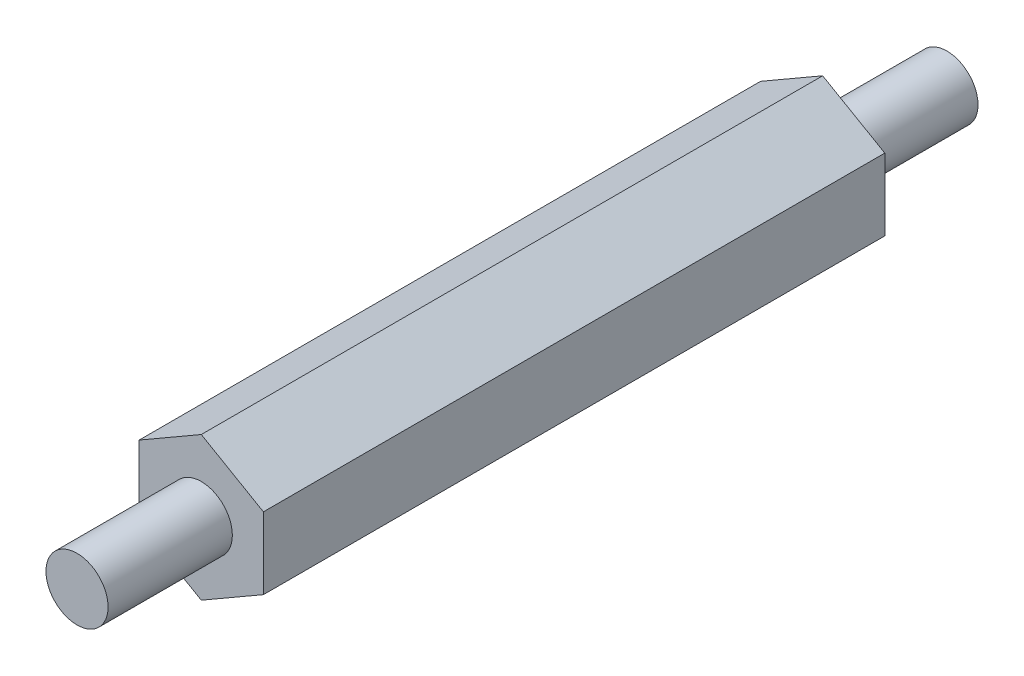
ISO-10303-21;
HEADER;
FILE_DESCRIPTION(('STEP AP214'),'2;1');
FILE_NAME('part.step','',(''),(''),'','','');
FILE_SCHEMA(('AUTOMOTIVE_DESIGN { 1 0 10303 214 1 1 1 1 }'));
ENDSEC;
DATA;
#1=APPLICATION_CONTEXT('core data for automotive mechanical design processes');
#2=APPLICATION_PROTOCOL_DEFINITION('international standard','automotive_design',2000,#1);
#3=PRODUCT_CONTEXT('',#1,'mechanical');
#4=PRODUCT('Part','Part','',(#3));
#5=PRODUCT_RELATED_PRODUCT_CATEGORY('part','',(#4));
#6=PRODUCT_DEFINITION_FORMATION('','',#4);
#7=PRODUCT_DEFINITION_CONTEXT('part definition',#1,'design');
#8=PRODUCT_DEFINITION('design','',#6,#7);
#9=PRODUCT_DEFINITION_SHAPE('','',#8);
#10=(LENGTH_UNIT() NAMED_UNIT(*) SI_UNIT(.MILLI.,.METRE.));
#11=(NAMED_UNIT(*) PLANE_ANGLE_UNIT() SI_UNIT($,.RADIAN.));
#12=(NAMED_UNIT(*) SI_UNIT($,.STERADIAN.) SOLID_ANGLE_UNIT());
#13=UNCERTAINTY_MEASURE_WITH_UNIT(LENGTH_MEASURE(1.E-05),#10,'distance_accuracy_value','');
#14=(GEOMETRIC_REPRESENTATION_CONTEXT(3) GLOBAL_UNCERTAINTY_ASSIGNED_CONTEXT((#13)) GLOBAL_UNIT_ASSIGNED_CONTEXT((#10,
#11,#12)) REPRESENTATION_CONTEXT('',''));
#15=CARTESIAN_POINT('',(0.,0.,0.));
#16=DIRECTION('',(0.,0.,1.));
#17=DIRECTION('',(1.,0.,0.));
#18=AXIS2_PLACEMENT_3D('',#15,#16,#17);
#19=CARTESIAN_POINT('',(2.08140106595602,1.86462753604946,30.));
#20=DIRECTION('',(-0.5,-0.866025403784439,0.));
#21=DIRECTION('',(0.866025403784439,-0.5,0.));
#22=AXIS2_PLACEMENT_3D('',#19,#20,#21);
#23=PLANE('',#22);
#24=DIRECTION('',(-0.866025403784439,0.5,0.));
#25=VECTOR('',#24,1.);
#26=CARTESIAN_POINT('',(2.08140106595602,1.86462753604946,0.));
#27=LINE('',#26,#25);
#28=CARTESIAN_POINT('',(2.08140106595602,1.86462753604946,0.));
#29=VERTEX_POINT('',#28);
#30=CARTESIAN_POINT('',(-0.918598934043976,3.59667834361834,0.));
#31=VERTEX_POINT('',#30);
#32=EDGE_CURVE('E118',#29,#31,#27,.T.);
#33=ORIENTED_EDGE('',*,*,#32,.T.);
#34=DIRECTION('',(0.,0.,-1.));
#35=VECTOR('',#34,1.);
#36=CARTESIAN_POINT('',(-0.918598934043976,3.59667834361834,30.));
#37=LINE('',#36,#35);
#38=CARTESIAN_POINT('',(-0.918598934043976,3.59667834361834,30.));
#39=VERTEX_POINT('',#38);
#40=EDGE_CURVE('E41',#39,#31,#37,.T.);
#41=ORIENTED_EDGE('',*,*,#40,.F.);
#42=DIRECTION('',(-0.866025403784439,0.5,0.));
#43=VECTOR('',#42,1.);
#44=CARTESIAN_POINT('',(2.08140106595602,1.86462753604946,30.));
#45=LINE('',#44,#43);
#46=CARTESIAN_POINT('',(2.08140106595602,1.86462753604946,30.));
#47=VERTEX_POINT('',#46);
#48=EDGE_CURVE('E129',#47,#39,#45,.T.);
#49=ORIENTED_EDGE('',*,*,#48,.F.);
#50=DIRECTION('',(0.,0.,-1.));
#51=VECTOR('',#50,1.);
#52=CARTESIAN_POINT('',(2.08140106595602,1.86462753604946,30.));
#53=LINE('',#52,#51);
#54=EDGE_CURVE('E114',#47,#29,#53,.T.);
#55=ORIENTED_EDGE('',*,*,#54,.T.);
#56=EDGE_LOOP('',(#33,#41,#49,#55));
#57=FACE_BOUND('',#56,.T.);
#58=ADVANCED_FACE('F33',(#57),#23,.F.);
#59=CARTESIAN_POINT('',(-0.918598934043976,3.59667834361834,30.));
#60=DIRECTION('',(0.5,-0.866025403784439,0.));
#61=DIRECTION('',(0.866025403784439,0.5,0.));
#62=AXIS2_PLACEMENT_3D('',#59,#60,#61);
#63=PLANE('',#62);
#64=DIRECTION('',(-0.866025403784439,-0.5,0.));
#65=VECTOR('',#64,1.);
#66=CARTESIAN_POINT('',(-0.918598934043976,3.59667834361834,0.));
#67=LINE('',#66,#65);
#68=CARTESIAN_POINT('',(-3.91859893404398,1.86462753604946,0.));
#69=VERTEX_POINT('',#68);
#70=EDGE_CURVE('E121',#31,#69,#67,.T.);
#71=ORIENTED_EDGE('',*,*,#70,.T.);
#72=DIRECTION('',(0.,0.,-1.));
#73=VECTOR('',#72,1.);
#74=CARTESIAN_POINT('',(-3.91859893404398,1.86462753604946,30.));
#75=LINE('',#74,#73);
#76=CARTESIAN_POINT('',(-3.91859893404398,1.86462753604946,30.));
#77=VERTEX_POINT('',#76);
#78=EDGE_CURVE('E133',#77,#69,#75,.T.);
#79=ORIENTED_EDGE('',*,*,#78,.F.);
#80=DIRECTION('',(-0.866025403784439,-0.5,0.));
#81=VECTOR('',#80,1.);
#82=CARTESIAN_POINT('',(-0.918598934043976,3.59667834361834,30.));
#83=LINE('',#82,#81);
#84=EDGE_CURVE('E87',#39,#77,#83,.T.);
#85=ORIENTED_EDGE('',*,*,#84,.F.);
#86=ORIENTED_EDGE('',*,*,#40,.T.);
#87=EDGE_LOOP('',(#71,#79,#85,#86));
#88=FACE_BOUND('',#87,.T.);
#89=ADVANCED_FACE('F136',(#88),#63,.F.);
#90=CARTESIAN_POINT('',(-3.91859893404398,1.86462753604946,30.));
#91=DIRECTION('',(1.,0.,0.));
#92=DIRECTION('',(0.,1.,0.));
#93=AXIS2_PLACEMENT_3D('',#90,#91,#92);
#94=PLANE('',#93);
#95=DIRECTION('',(0.,-1.,0.));
#96=VECTOR('',#95,1.);
#97=CARTESIAN_POINT('',(-3.91859893404398,1.86462753604946,0.));
#98=LINE('',#97,#96);
#99=CARTESIAN_POINT('',(-3.91859893404398,-1.59947407908829,0.));
#100=VERTEX_POINT('',#99);
#101=EDGE_CURVE('E124',#69,#100,#98,.T.);
#102=ORIENTED_EDGE('',*,*,#101,.T.);
#103=DIRECTION('',(0.,0.,-1.));
#104=VECTOR('',#103,1.);
#105=CARTESIAN_POINT('',(-3.91859893404398,-1.59947407908829,30.));
#106=LINE('',#105,#104);
#107=CARTESIAN_POINT('',(-3.91859893404398,-1.59947407908829,30.));
#108=VERTEX_POINT('',#107);
#109=EDGE_CURVE('E109',#108,#100,#106,.T.);
#110=ORIENTED_EDGE('',*,*,#109,.F.);
#111=DIRECTION('',(0.,-1.,0.));
#112=VECTOR('',#111,1.);
#113=CARTESIAN_POINT('',(-3.91859893404398,1.86462753604946,30.));
#114=LINE('',#113,#112);
#115=EDGE_CURVE('E100',#77,#108,#114,.T.);
#116=ORIENTED_EDGE('',*,*,#115,.F.);
#117=ORIENTED_EDGE('',*,*,#78,.T.);
#118=EDGE_LOOP('',(#102,#110,#116,#117));
#119=FACE_BOUND('',#118,.T.);
#120=ADVANCED_FACE('F144',(#119),#94,.F.);
#121=CARTESIAN_POINT('',(-3.91859893404398,-1.59947407908829,30.));
#122=DIRECTION('',(0.5,0.866025403784438,0.));
#123=DIRECTION('',(-0.866025403784439,0.5,0.));
#124=AXIS2_PLACEMENT_3D('',#121,#122,#123);
#125=PLANE('',#124);
#126=DIRECTION('',(0.866025403784438,-0.5,0.));
#127=VECTOR('',#126,1.);
#128=CARTESIAN_POINT('',(-3.91859893404398,-1.59947407908829,0.));
#129=LINE('',#128,#127);
#130=CARTESIAN_POINT('',(-0.91859893404398,-3.33152488665717,0.));
#131=VERTEX_POINT('',#130);
#132=EDGE_CURVE('E108',#100,#131,#129,.T.);
#133=ORIENTED_EDGE('',*,*,#132,.T.);
#134=DIRECTION('',(0.,0.,-1.));
#135=VECTOR('',#134,1.);
#136=CARTESIAN_POINT('',(-0.91859893404398,-3.33152488665717,30.));
#137=LINE('',#136,#135);
#138=CARTESIAN_POINT('',(-0.91859893404398,-3.33152488665717,30.));
#139=VERTEX_POINT('',#138);
#140=EDGE_CURVE('E105',#139,#131,#137,.T.);
#141=ORIENTED_EDGE('',*,*,#140,.F.);
#142=DIRECTION('',(0.866025403784438,-0.5,0.));
#143=VECTOR('',#142,1.);
#144=CARTESIAN_POINT('',(-3.91859893404398,-1.59947407908829,30.));
#145=LINE('',#144,#143);
#146=EDGE_CURVE('E94',#108,#139,#145,.T.);
#147=ORIENTED_EDGE('',*,*,#146,.F.);
#148=ORIENTED_EDGE('',*,*,#109,.T.);
#149=EDGE_LOOP('',(#133,#141,#147,#148));
#150=FACE_BOUND('',#149,.T.);
#151=ADVANCED_FACE('F106',(#150),#125,.F.);
#152=CARTESIAN_POINT('',(-0.91859893404398,-3.33152488665717,30.));
#153=DIRECTION('',(-0.5,0.866025403784438,0.));
#154=DIRECTION('',(-0.866025403784438,-0.5,0.));
#155=AXIS2_PLACEMENT_3D('',#152,#153,#154);
#156=PLANE('',#155);
#157=DIRECTION('',(0.866025403784438,0.5,0.));
#158=VECTOR('',#157,1.);
#159=CARTESIAN_POINT('',(-0.91859893404398,-3.33152488665717,0.));
#160=LINE('',#159,#158);
#161=CARTESIAN_POINT('',(2.08140106595602,-1.59947407908829,0.));
#162=VERTEX_POINT('',#161);
#163=EDGE_CURVE('E72',#131,#162,#160,.T.);
#164=ORIENTED_EDGE('',*,*,#163,.T.);
#165=DIRECTION('',(0.,0.,-1.));
#166=VECTOR('',#165,1.);
#167=CARTESIAN_POINT('',(2.08140106595602,-1.59947407908829,30.));
#168=LINE('',#167,#166);
#169=CARTESIAN_POINT('',(2.08140106595602,-1.59947407908829,30.));
#170=VERTEX_POINT('',#169);
#171=EDGE_CURVE('E110',#170,#162,#168,.T.);
#172=ORIENTED_EDGE('',*,*,#171,.F.);
#173=DIRECTION('',(0.866025403784438,0.5,0.));
#174=VECTOR('',#173,1.);
#175=CARTESIAN_POINT('',(-0.91859893404398,-3.33152488665717,30.));
#176=LINE('',#175,#174);
#177=EDGE_CURVE('E98',#139,#170,#176,.T.);
#178=ORIENTED_EDGE('',*,*,#177,.F.);
#179=ORIENTED_EDGE('',*,*,#140,.T.);
#180=EDGE_LOOP('',(#164,#172,#178,#179));
#181=FACE_BOUND('',#180,.T.);
#182=ADVANCED_FACE('F112',(#181),#156,.F.);
#183=CARTESIAN_POINT('',(2.08140106595602,-1.59947407908829,30.));
#184=DIRECTION('',(-1.,0.,0.));
#185=DIRECTION('',(0.,0.,1.));
#186=AXIS2_PLACEMENT_3D('',#183,#184,#185);
#187=PLANE('',#186);
#188=DIRECTION('',(0.,1.,0.));
#189=VECTOR('',#188,1.);
#190=CARTESIAN_POINT('',(2.08140106595602,-1.59947407908829,0.));
#191=LINE('',#190,#189);
#192=EDGE_CURVE('E78',#162,#29,#191,.T.);
#193=ORIENTED_EDGE('',*,*,#192,.T.);
#194=ORIENTED_EDGE('',*,*,#54,.F.);
#195=DIRECTION('',(0.,1.,0.));
#196=VECTOR('',#195,1.);
#197=CARTESIAN_POINT('',(2.08140106595602,-1.59947407908829,30.));
#198=LINE('',#197,#196);
#199=EDGE_CURVE('E49',#170,#47,#198,.T.);
#200=ORIENTED_EDGE('',*,*,#199,.F.);
#201=ORIENTED_EDGE('',*,*,#171,.T.);
#202=EDGE_LOOP('',(#193,#194,#200,#201));
#203=FACE_BOUND('',#202,.T.);
#204=ADVANCED_FACE('F175',(#203),#187,.F.);
#205=CARTESIAN_POINT('',(0.,0.,30.));
#206=DIRECTION('',(0.,0.,1.));
#207=DIRECTION('',(1.,0.,0.));
#208=AXIS2_PLACEMENT_3D('',#205,#206,#207);
#209=PLANE('',#208);
#210=CARTESIAN_POINT('',(-0.91859893404398,0.132576728480584,30.));
#211=DIRECTION('',(0.,0.,1.));
#212=DIRECTION('',(1.,0.,0.));
#213=AXIS2_PLACEMENT_3D('',#210,#211,#212);
#214=CIRCLE('',#213,1.5);
#215=CARTESIAN_POINT('',(0.58140106595602,0.132576728480584,30.));
#216=VERTEX_POINT('',#215);
#217=EDGE_CURVE('E148',#216,#216,#214,.T.);
#218=ORIENTED_EDGE('',*,*,#217,.F.);
#219=EDGE_LOOP('',(#218));
#220=FACE_BOUND('',#219,.T.);
#221=ORIENTED_EDGE('',*,*,#48,.T.);
#222=ORIENTED_EDGE('',*,*,#84,.T.);
#223=ORIENTED_EDGE('',*,*,#115,.T.);
#224=ORIENTED_EDGE('',*,*,#146,.T.);
#225=ORIENTED_EDGE('',*,*,#177,.T.);
#226=ORIENTED_EDGE('',*,*,#199,.T.);
#227=EDGE_LOOP('',(#221,#222,#223,#224,#225,#226));
#228=FACE_BOUND('',#227,.T.);
#229=ADVANCED_FACE('F96',(#220,#228),#209,.T.);
#230=CARTESIAN_POINT('',(0.,0.,0.));
#231=DIRECTION('',(0.,0.,1.));
#232=DIRECTION('',(1.,0.,0.));
#233=AXIS2_PLACEMENT_3D('',#230,#231,#232);
#234=PLANE('',#233);
#235=CARTESIAN_POINT('',(-0.91859893404398,0.132576728480583,0.));
#236=DIRECTION('',(0.,0.,1.));
#237=DIRECTION('',(1.,0.,0.));
#238=AXIS2_PLACEMENT_3D('',#235,#236,#237);
#239=CIRCLE('',#238,1.5);
#240=CARTESIAN_POINT('',(0.58140106595602,0.132576728480583,0.));
#241=VERTEX_POINT('',#240);
#242=EDGE_CURVE('E11',#241,#241,#239,.F.);
#243=ORIENTED_EDGE('',*,*,#242,.F.);
#244=EDGE_LOOP('',(#243));
#245=FACE_BOUND('',#244,.T.);
#246=ORIENTED_EDGE('',*,*,#32,.F.);
#247=ORIENTED_EDGE('',*,*,#192,.F.);
#248=ORIENTED_EDGE('',*,*,#163,.F.);
#249=ORIENTED_EDGE('',*,*,#132,.F.);
#250=ORIENTED_EDGE('',*,*,#101,.F.);
#251=ORIENTED_EDGE('',*,*,#70,.F.);
#252=EDGE_LOOP('',(#246,#247,#248,#249,#250,#251));
#253=FACE_BOUND('',#252,.T.);
#254=ADVANCED_FACE('F141',(#245,#253),#234,.F.);
#255=CARTESIAN_POINT('',(-0.91859893404398,0.132576728480584,36.));
#256=DIRECTION('',(0.,0.,-1.));
#257=DIRECTION('',(-1.,0.,0.));
#258=AXIS2_PLACEMENT_3D('',#255,#256,#257);
#259=CYLINDRICAL_SURFACE('',#258,1.5);
#260=CARTESIAN_POINT('',(-0.91859893404398,0.132576728480584,36.));
#261=DIRECTION('',(0.,0.,1.));
#262=DIRECTION('',(1.,0.,0.));
#263=AXIS2_PLACEMENT_3D('',#260,#261,#262);
#264=CIRCLE('',#263,1.5);
#265=CARTESIAN_POINT('',(0.58140106595602,0.132576728480584,36.));
#266=VERTEX_POINT('',#265);
#267=EDGE_CURVE('E122',#266,#266,#264,.T.);
#268=ORIENTED_EDGE('',*,*,#267,.F.);
#269=EDGE_LOOP('',(#268));
#270=FACE_BOUND('',#269,.T.);
#271=ORIENTED_EDGE('',*,*,#217,.T.);
#272=EDGE_LOOP('',(#271));
#273=FACE_BOUND('',#272,.T.);
#274=ADVANCED_FACE('F167',(#270,#273),#259,.T.);
#275=CARTESIAN_POINT('',(-0.91859893404398,0.132576728480584,36.));
#276=DIRECTION('',(0.,0.,1.));
#277=DIRECTION('',(1.,0.,0.));
#278=AXIS2_PLACEMENT_3D('',#275,#276,#277);
#279=PLANE('',#278);
#280=ORIENTED_EDGE('',*,*,#267,.T.);
#281=EDGE_LOOP('',(#280));
#282=FACE_BOUND('',#281,.T.);
#283=ADVANCED_FACE('F162',(#282),#279,.T.);
#284=CARTESIAN_POINT('',(-0.91859893404398,0.132576728480583,-6.));
#285=DIRECTION('',(0.,0.,1.));
#286=DIRECTION('',(1.,0.,0.));
#287=AXIS2_PLACEMENT_3D('',#284,#285,#286);
#288=CYLINDRICAL_SURFACE('',#287,1.5);
#289=CARTESIAN_POINT('',(-0.91859893404398,0.132576728480583,-6.));
#290=DIRECTION('',(0.,0.,-1.));
#291=DIRECTION('',(-1.,0.,0.));
#292=AXIS2_PLACEMENT_3D('',#289,#290,#291);
#293=CIRCLE('',#292,1.5);
#294=CARTESIAN_POINT('',(-2.41859893404398,0.132576728480583,-6.));
#295=VERTEX_POINT('',#294);
#296=EDGE_CURVE('E151',#295,#295,#293,.T.);
#297=ORIENTED_EDGE('',*,*,#296,.F.);
#298=EDGE_LOOP('',(#297));
#299=FACE_BOUND('',#298,.T.);
#300=ORIENTED_EDGE('',*,*,#242,.T.);
#301=EDGE_LOOP('',(#300));
#302=FACE_BOUND('',#301,.T.);
#303=ADVANCED_FACE('F159',(#299,#302),#288,.T.);
#304=CARTESIAN_POINT('',(-0.91859893404398,0.132576728480583,-6.));
#305=DIRECTION('',(0.,0.,-1.));
#306=DIRECTION('',(-1.,0.,0.));
#307=AXIS2_PLACEMENT_3D('',#304,#305,#306);
#308=PLANE('',#307);
#309=ORIENTED_EDGE('',*,*,#296,.T.);
#310=EDGE_LOOP('',(#309));
#311=FACE_BOUND('',#310,.T.);
#312=ADVANCED_FACE('F157',(#311),#308,.T.);
#313=CLOSED_SHELL('',(#58,#89,#120,#151,#182,#204,#229,#254,#274,#283,#303,#312));
#314=MANIFOLD_SOLID_BREP('B2',#313);
#315=ADVANCED_BREP_SHAPE_REPRESENTATION('',(#18,#314),#14);
#316=SHAPE_DEFINITION_REPRESENTATION(#9,#315);
ENDSEC;
END-ISO-10303-21;
